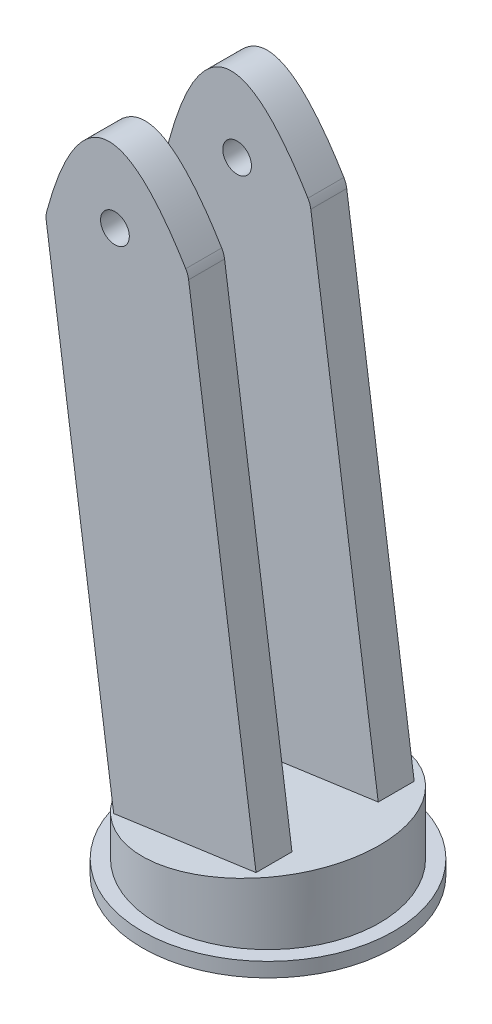
ISO-10303-21;
HEADER;
FILE_DESCRIPTION(('STEP AP214'),'2;1');
FILE_NAME('part.step','',(''),(''),'','','');
FILE_SCHEMA(('AUTOMOTIVE_DESIGN { 1 0 10303 214 1 1 1 1 }'));
ENDSEC;
DATA;
#1=APPLICATION_CONTEXT('core data for automotive mechanical design processes');
#2=APPLICATION_PROTOCOL_DEFINITION('international standard','automotive_design',2000,#1);
#3=PRODUCT_CONTEXT('',#1,'mechanical');
#4=PRODUCT('Part','Part','',(#3));
#5=PRODUCT_RELATED_PRODUCT_CATEGORY('part','',(#4));
#6=PRODUCT_DEFINITION_FORMATION('','',#4);
#7=PRODUCT_DEFINITION_CONTEXT('part definition',#1,'design');
#8=PRODUCT_DEFINITION('design','',#6,#7);
#9=PRODUCT_DEFINITION_SHAPE('','',#8);
#10=(LENGTH_UNIT() NAMED_UNIT(*) SI_UNIT(.MILLI.,.METRE.));
#11=(NAMED_UNIT(*) PLANE_ANGLE_UNIT() SI_UNIT($,.RADIAN.));
#12=(NAMED_UNIT(*) SI_UNIT($,.STERADIAN.) SOLID_ANGLE_UNIT());
#13=UNCERTAINTY_MEASURE_WITH_UNIT(LENGTH_MEASURE(1.E-05),#10,'distance_accuracy_value','');
#14=(GEOMETRIC_REPRESENTATION_CONTEXT(3) GLOBAL_UNCERTAINTY_ASSIGNED_CONTEXT((#13)) GLOBAL_UNIT_ASSIGNED_CONTEXT((#10,
#11,#12)) REPRESENTATION_CONTEXT('',''));
#15=CARTESIAN_POINT('',(0.,0.,0.));
#16=DIRECTION('',(0.,0.,1.));
#17=DIRECTION('',(1.,0.,0.));
#18=AXIS2_PLACEMENT_3D('',#15,#16,#17);
#19=CARTESIAN_POINT('',(-21.6082937179394,86.9277411037629,-6.));
#20=DIRECTION('',(0.,0.,1.));
#21=DIRECTION('',(1.,0.,0.));
#22=AXIS2_PLACEMENT_3D('',#19,#20,#21);
#23=PLANE('',#22);
#24=DIRECTION('',(0.139173100960066,-0.99026806874157,0.));
#25=VECTOR('',#24,1.);
#26=CARTESIAN_POINT('',(-1.80293234310799,89.7112031229642,-6.));
#27=LINE('',#26,#25);
#28=CARTESIAN_POINT('',(-0.0484230605807445,77.2272208964279,-6.));
#29=VERTEX_POINT('',#28);
#30=CARTESIAN_POINT('',(9.33091573369727,10.4897576236386,-6.));
#31=VERTEX_POINT('',#30);
#32=EDGE_CURVE('E280',#29,#31,#27,.T.);
#33=ORIENTED_EDGE('',*,*,#32,.F.);
#34=CARTESIAN_POINT('',(-3.01922726680545,76.8097015935476,-6.));
#35=DIRECTION('',(0.,0.,1.));
#36=DIRECTION('',(1.,0.,0.));
#37=AXIS2_PLACEMENT_3D('',#34,#35,#36);
#38=CIRCLE('',#37,3.);
#39=CARTESIAN_POINT('',(-0.45097420467747,78.3602099646538,-6.));
#40=VERTEX_POINT('',#39);
#41=EDGE_CURVE('E377',#29,#40,#38,.T.);
#42=ORIENTED_EDGE('',*,*,#41,.T.);
#43=CARTESIAN_POINT('',(-19.9382165064186,75.044524278864,-6.));
#44=CARTESIAN_POINT('',(-13.3756902420445,100.202688938262,-6.));
#45=CARTESIAN_POINT('',(-0.132855131587199,77.8279862980654,-6.));
#46=B_SPLINE_CURVE_WITH_KNOTS('',2,(#43,#44,#45),.UNSPECIFIED.,.F.,.F.,(3,3),(0.,1.),.UNSPECIFIED.);
#47=CARTESIAN_POINT('',(-19.7791215508712,75.6438160033689,-6.));
#48=VERTEX_POINT('',#47);
#49=EDGE_CURVE('E269',#40,#48,#46,.F.);
#50=ORIENTED_EDGE('',*,*,#49,.T.);
#51=CARTESIAN_POINT('',(-16.8829802291874,74.8612781801067,-6.));
#52=DIRECTION('',(0.,0.,1.));
#53=DIRECTION('',(1.,0.,0.));
#54=AXIS2_PLACEMENT_3D('',#51,#52,#53);
#55=CIRCLE('',#54,3.);
#56=CARTESIAN_POINT('',(-19.8537844354122,74.4437588772265,-6.));
#57=VERTEX_POINT('',#56);
#58=EDGE_CURVE('E378',#48,#57,#55,.T.);
#59=ORIENTED_EDGE('',*,*,#58,.T.);
#60=DIRECTION('',(0.139173100960066,-0.99026806874157,0.));
#61=VECTOR('',#60,1.);
#62=CARTESIAN_POINT('',(-21.6082937179394,86.9277411037629,-6.));
#63=LINE('',#62,#61);
#64=CARTESIAN_POINT('',(-10.4744456411341,7.70629560443725,-6.));
#65=VERTEX_POINT('',#64);
#66=EDGE_CURVE('E282',#57,#65,#63,.T.);
#67=ORIENTED_EDGE('',*,*,#66,.T.);
#68=DIRECTION('',(-0.99026806874157,-0.139173100960066,0.));
#69=VECTOR('',#68,1.);
#70=CARTESIAN_POINT('',(-10.4744456411341,7.70629560443725,-6.));
#71=LINE('',#70,#69);
#72=EDGE_CURVE('E268',#31,#65,#71,.T.);
#73=ORIENTED_EDGE('',*,*,#72,.F.);
#74=EDGE_LOOP('',(#33,#42,#50,#59,#67,#73));
#75=FACE_BOUND('',#74,.T.);
#76=CARTESIAN_POINT('',(-10.3002046834998,78.3194721133635,-6.));
#77=DIRECTION('',(0.,0.,1.));
#78=DIRECTION('',(1.,0.,0.));
#79=AXIS2_PLACEMENT_3D('',#76,#77,#78);
#80=CIRCLE('',#79,2.);
#81=CARTESIAN_POINT('',(-8.30020468349977,78.3194721133635,-6.));
#82=VERTEX_POINT('',#81);
#83=EDGE_CURVE('E459',#82,#82,#80,.F.);
#84=ORIENTED_EDGE('',*,*,#83,.T.);
#85=EDGE_LOOP('',(#84));
#86=FACE_BOUND('',#85,.T.);
#87=ADVANCED_FACE('F159',(#75,#86),#23,.T.);
#88=CARTESIAN_POINT('',(-21.6082937179394,86.9277411037629,-11.));
#89=DIRECTION('',(0.,0.,-1.));
#90=DIRECTION('',(-1.,0.,0.));
#91=AXIS2_PLACEMENT_3D('',#88,#89,#90);
#92=PLANE('',#91);
#93=CARTESIAN_POINT('',(-19.9382165064186,75.044524278864,-11.));
#94=CARTESIAN_POINT('',(-13.3756902420445,100.202688938262,-11.));
#95=CARTESIAN_POINT('',(-0.132855131587199,77.8279862980654,-11.));
#96=B_SPLINE_CURVE_WITH_KNOTS('',2,(#93,#94,#95),.UNSPECIFIED.,.F.,.F.,(3,3),(0.,1.),.UNSPECIFIED.);
#97=CARTESIAN_POINT('',(-19.7791215508712,75.6438160033689,-11.));
#98=VERTEX_POINT('',#97);
#99=CARTESIAN_POINT('',(-0.45097420467747,78.3602099646538,-11.));
#100=VERTEX_POINT('',#99);
#101=EDGE_CURVE('E388',#98,#100,#96,.T.);
#102=ORIENTED_EDGE('',*,*,#101,.T.);
#103=CARTESIAN_POINT('',(-3.01922726680545,76.8097015935476,-11.));
#104=DIRECTION('',(0.,0.,-1.));
#105=DIRECTION('',(-1.,0.,0.));
#106=AXIS2_PLACEMENT_3D('',#103,#104,#105);
#107=CIRCLE('',#106,3.);
#108=CARTESIAN_POINT('',(-0.0484230605807445,77.2272208964279,-11.));
#109=VERTEX_POINT('',#108);
#110=EDGE_CURVE('E167',#100,#109,#107,.T.);
#111=ORIENTED_EDGE('',*,*,#110,.T.);
#112=DIRECTION('',(0.139173100960066,-0.99026806874157,0.));
#113=VECTOR('',#112,1.);
#114=CARTESIAN_POINT('',(-1.80293234310799,89.7112031229642,-11.));
#115=LINE('',#114,#113);
#116=CARTESIAN_POINT('',(9.33091573369727,10.4897576236386,-11.));
#117=VERTEX_POINT('',#116);
#118=EDGE_CURVE('E257',#109,#117,#115,.T.);
#119=ORIENTED_EDGE('',*,*,#118,.T.);
#120=DIRECTION('',(0.99026806874157,0.139173100960066,0.));
#121=VECTOR('',#120,1.);
#122=CARTESIAN_POINT('',(-10.4744456411341,7.70629560443725,-11.));
#123=LINE('',#122,#121);
#124=CARTESIAN_POINT('',(-10.4744456411341,7.70629560443725,-11.));
#125=VERTEX_POINT('',#124);
#126=EDGE_CURVE('E258',#125,#117,#123,.T.);
#127=ORIENTED_EDGE('',*,*,#126,.F.);
#128=DIRECTION('',(0.139173100960066,-0.99026806874157,0.));
#129=VECTOR('',#128,1.);
#130=CARTESIAN_POINT('',(-21.6082937179394,86.9277411037629,-11.));
#131=LINE('',#130,#129);
#132=CARTESIAN_POINT('',(-19.8537844354122,74.4437588772265,-11.));
#133=VERTEX_POINT('',#132);
#134=EDGE_CURVE('E250',#133,#125,#131,.T.);
#135=ORIENTED_EDGE('',*,*,#134,.F.);
#136=CARTESIAN_POINT('',(-16.8829802291874,74.8612781801067,-11.));
#137=DIRECTION('',(0.,0.,-1.));
#138=DIRECTION('',(-1.,0.,0.));
#139=AXIS2_PLACEMENT_3D('',#136,#137,#138);
#140=CIRCLE('',#139,3.);
#141=EDGE_CURVE('E174',#133,#98,#140,.T.);
#142=ORIENTED_EDGE('',*,*,#141,.T.);
#143=EDGE_LOOP('',(#102,#111,#119,#127,#135,#142));
#144=FACE_BOUND('',#143,.T.);
#145=CARTESIAN_POINT('',(-10.3002046834998,78.3194721133635,-11.));
#146=DIRECTION('',(0.,0.,1.));
#147=DIRECTION('',(1.,0.,0.));
#148=AXIS2_PLACEMENT_3D('',#145,#146,#147);
#149=CIRCLE('',#148,2.);
#150=CARTESIAN_POINT('',(-8.30020468349977,78.3194721133635,-11.));
#151=VERTEX_POINT('',#150);
#152=EDGE_CURVE('E470',#151,#151,#149,.T.);
#153=ORIENTED_EDGE('',*,*,#152,.T.);
#154=EDGE_LOOP('',(#153));
#155=FACE_BOUND('',#154,.T.);
#156=ADVANCED_FACE('F271',(#144,#155),#92,.T.);
#157=CARTESIAN_POINT('',(-1.80293234310799,89.7112031229642,-11.));
#158=DIRECTION('',(0.99026806874157,0.139173100960066,0.));
#159=DIRECTION('',(-0.139173100960066,0.99026806874157,0.));
#160=AXIS2_PLACEMENT_3D('',#157,#158,#159);
#161=PLANE('',#160);
#162=ORIENTED_EDGE('',*,*,#118,.F.);
#163=DIRECTION('',(0.,0.,-1.));
#164=VECTOR('',#163,1.);
#165=CARTESIAN_POINT('',(-0.0484230605807445,77.2272208964279,-11.));
#166=LINE('',#165,#164);
#167=EDGE_CURVE('E376',#109,#29,#166,.F.);
#168=ORIENTED_EDGE('',*,*,#167,.T.);
#169=ORIENTED_EDGE('',*,*,#32,.T.);
#170=DIRECTION('',(0.,0.,1.));
#171=VECTOR('',#170,1.);
#172=CARTESIAN_POINT('',(9.33091573369727,10.4897576236386,-11.));
#173=LINE('',#172,#171);
#174=EDGE_CURVE('E274',#117,#31,#173,.T.);
#175=ORIENTED_EDGE('',*,*,#174,.F.);
#176=EDGE_LOOP('',(#162,#168,#169,#175));
#177=FACE_BOUND('',#176,.T.);
#178=ADVANCED_FACE('F362',(#177),#161,.T.);
#179=CARTESIAN_POINT('',(-21.6082937179394,86.9277411037629,-11.));
#180=DIRECTION('',(-0.99026806874157,-0.139173100960066,0.));
#181=DIRECTION('',(0.139173100960066,-0.99026806874157,0.));
#182=AXIS2_PLACEMENT_3D('',#179,#180,#181);
#183=PLANE('',#182);
#184=ORIENTED_EDGE('',*,*,#66,.F.);
#185=DIRECTION('',(0.,0.,-1.));
#186=VECTOR('',#185,1.);
#187=CARTESIAN_POINT('',(-19.8537844354122,74.4437588772265,-11.));
#188=LINE('',#187,#186);
#189=EDGE_CURVE('E13',#57,#133,#188,.T.);
#190=ORIENTED_EDGE('',*,*,#189,.T.);
#191=ORIENTED_EDGE('',*,*,#134,.T.);
#192=DIRECTION('',(0.,0.,-1.));
#193=VECTOR('',#192,1.);
#194=CARTESIAN_POINT('',(-10.4744456411341,7.70629560443725,-11.));
#195=LINE('',#194,#193);
#196=EDGE_CURVE('E254',#65,#125,#195,.T.);
#197=ORIENTED_EDGE('',*,*,#196,.F.);
#198=EDGE_LOOP('',(#184,#190,#191,#197));
#199=FACE_BOUND('',#198,.T.);
#200=ADVANCED_FACE('F253',(#199),#183,.T.);
#201=CARTESIAN_POINT('',(-1.26495260183753,9.00060544336586,0.));
#202=DIRECTION('',(-0.139173100960066,0.99026806874157,0.));
#203=DIRECTION('',(-0.99026806874157,-0.139173100960066,0.));
#204=AXIS2_PLACEMENT_3D('',#201,#202,#203);
#205=PLANE('',#204);
#206=ORIENTED_EDGE('',*,*,#196,.T.);
#207=ORIENTED_EDGE('',*,*,#126,.T.);
#208=ORIENTED_EDGE('',*,*,#174,.T.);
#209=ORIENTED_EDGE('',*,*,#72,.T.);
#210=EDGE_LOOP('',(#206,#207,#208,#209));
#211=FACE_BOUND('',#210,.T.);
#212=CARTESIAN_POINT('',(0.,9.17838293788707,0.));
#213=DIRECTION('',(-0.139173100960066,0.99026806874157,0.));
#214=DIRECTION('',(-0.99026806874157,-0.139173100960066,0.));
#215=AXIS2_PLACEMENT_3D('',#212,#213,#214);
#216=ELLIPSE('',#215,15.6523273740386,15.5);
#217=CARTESIAN_POINT('',(-15.5,7.,0.));
#218=VERTEX_POINT('',#217);
#219=EDGE_CURVE('E403',#218,#218,#216,.T.);
#220=ORIENTED_EDGE('',*,*,#219,.T.);
#221=EDGE_LOOP('',(#220));
#222=FACE_BOUND('',#221,.T.);
#223=DIRECTION('',(0.99026806874157,0.139173100960066,0.));
#224=VECTOR('',#223,1.);
#225=CARTESIAN_POINT('',(-10.4744456411341,7.70629560443725,11.));
#226=LINE('',#225,#224);
#227=CARTESIAN_POINT('',(-10.4744456411341,7.70629560443725,11.));
#228=VERTEX_POINT('',#227);
#229=CARTESIAN_POINT('',(9.33091573369727,10.4897576236386,11.));
#230=VERTEX_POINT('',#229);
#231=EDGE_CURVE('E598',#228,#230,#226,.T.);
#232=ORIENTED_EDGE('',*,*,#231,.F.);
#233=DIRECTION('',(0.,0.,1.));
#234=VECTOR('',#233,1.);
#235=CARTESIAN_POINT('',(-10.4744456411341,7.70629560443725,11.));
#236=LINE('',#235,#234);
#237=CARTESIAN_POINT('',(-10.4744456411341,7.70629560443725,6.));
#238=VERTEX_POINT('',#237);
#239=EDGE_CURVE('E436',#238,#228,#236,.T.);
#240=ORIENTED_EDGE('',*,*,#239,.F.);
#241=DIRECTION('',(-0.99026806874157,-0.139173100960066,0.));
#242=VECTOR('',#241,1.);
#243=CARTESIAN_POINT('',(-10.4744456411341,7.70629560443725,6.));
#244=LINE('',#243,#242);
#245=CARTESIAN_POINT('',(9.33091573369727,10.4897576236386,6.));
#246=VERTEX_POINT('',#245);
#247=EDGE_CURVE('E608',#246,#238,#244,.T.);
#248=ORIENTED_EDGE('',*,*,#247,.F.);
#249=DIRECTION('',(0.,0.,-1.));
#250=VECTOR('',#249,1.);
#251=CARTESIAN_POINT('',(9.33091573369727,10.4897576236386,11.));
#252=LINE('',#251,#250);
#253=EDGE_CURVE('E426',#230,#246,#252,.T.);
#254=ORIENTED_EDGE('',*,*,#253,.F.);
#255=EDGE_LOOP('',(#232,#240,#248,#254));
#256=FACE_BOUND('',#255,.T.);
#257=ADVANCED_FACE('F263',(#211,#222,#256),#205,.T.);
#258=CARTESIAN_POINT('',(0.,12.,0.));
#259=DIRECTION('',(0.,-1.,0.));
#260=DIRECTION('',(0.,0.,-1.));
#261=AXIS2_PLACEMENT_3D('',#258,#259,#260);
#262=CYLINDRICAL_SURFACE('',#261,15.5);
#263=CARTESIAN_POINT('',(0.,2.,0.));
#264=DIRECTION('',(0.,1.,0.));
#265=DIRECTION('',(0.,0.,1.));
#266=AXIS2_PLACEMENT_3D('',#263,#264,#265);
#267=CIRCLE('',#266,15.5);
#268=CARTESIAN_POINT('',(0.,2.,15.5));
#269=VERTEX_POINT('',#268);
#270=EDGE_CURVE('E615',#269,#269,#267,.T.);
#271=ORIENTED_EDGE('',*,*,#270,.T.);
#272=EDGE_LOOP('',(#271));
#273=FACE_BOUND('',#272,.T.);
#274=ORIENTED_EDGE('',*,*,#219,.F.);
#275=EDGE_LOOP('',(#274));
#276=FACE_BOUND('',#275,.T.);
#277=ADVANCED_FACE('F326',(#273,#276),#262,.T.);
#278=CARTESIAN_POINT('',(0.,2.,0.));
#279=DIRECTION('',(0.,-1.,0.));
#280=DIRECTION('',(0.,0.,-1.));
#281=AXIS2_PLACEMENT_3D('',#278,#279,#280);
#282=CYLINDRICAL_SURFACE('',#281,17.5);
#283=CARTESIAN_POINT('',(0.,2.,0.));
#284=DIRECTION('',(0.,1.,0.));
#285=DIRECTION('',(0.,0.,1.));
#286=AXIS2_PLACEMENT_3D('',#283,#284,#285);
#287=CIRCLE('',#286,17.5);
#288=CARTESIAN_POINT('',(0.,2.,17.5));
#289=VERTEX_POINT('',#288);
#290=EDGE_CURVE('E618',#289,#289,#287,.T.);
#291=ORIENTED_EDGE('',*,*,#290,.F.);
#292=EDGE_LOOP('',(#291));
#293=FACE_BOUND('',#292,.T.);
#294=CARTESIAN_POINT('',(0.,0.,0.));
#295=DIRECTION('',(0.,1.,0.));
#296=DIRECTION('',(0.,0.,1.));
#297=AXIS2_PLACEMENT_3D('',#294,#295,#296);
#298=CIRCLE('',#297,17.5);
#299=CARTESIAN_POINT('',(0.,0.,17.5));
#300=VERTEX_POINT('',#299);
#301=EDGE_CURVE('E614',#300,#300,#298,.T.);
#302=ORIENTED_EDGE('',*,*,#301,.T.);
#303=EDGE_LOOP('',(#302));
#304=FACE_BOUND('',#303,.T.);
#305=ADVANCED_FACE('F329',(#293,#304),#282,.T.);
#306=CARTESIAN_POINT('',(0.,2.,0.));
#307=DIRECTION('',(0.,1.,0.));
#308=DIRECTION('',(0.,0.,1.));
#309=AXIS2_PLACEMENT_3D('',#306,#307,#308);
#310=PLANE('',#309);
#311=ORIENTED_EDGE('',*,*,#270,.F.);
#312=EDGE_LOOP('',(#311));
#313=FACE_BOUND('',#312,.T.);
#314=ORIENTED_EDGE('',*,*,#290,.T.);
#315=EDGE_LOOP('',(#314));
#316=FACE_BOUND('',#315,.T.);
#317=ADVANCED_FACE('F331',(#313,#316),#310,.T.);
#318=CARTESIAN_POINT('',(0.,0.,0.));
#319=DIRECTION('',(0.,1.,0.));
#320=DIRECTION('',(0.,0.,1.));
#321=AXIS2_PLACEMENT_3D('',#318,#319,#320);
#322=PLANE('',#321);
#323=ORIENTED_EDGE('',*,*,#301,.F.);
#324=EDGE_LOOP('',(#323));
#325=FACE_BOUND('',#324,.T.);
#326=ADVANCED_FACE('F322',(#325),#322,.F.);
#327=CARTESIAN_POINT('',(-21.6082937179394,86.9277411037629,11.));
#328=DIRECTION('',(0.99026806874157,0.139173100960066,0.));
#329=DIRECTION('',(-0.139173100960066,0.99026806874157,0.));
#330=AXIS2_PLACEMENT_3D('',#327,#328,#329);
#331=PLANE('',#330);
#332=DIRECTION('',(0.139173100960066,-0.99026806874157,0.));
#333=VECTOR('',#332,1.);
#334=CARTESIAN_POINT('',(-21.6082937179394,86.9277411037629,11.));
#335=LINE('',#334,#333);
#336=CARTESIAN_POINT('',(-19.8537844354122,74.4437588772265,11.));
#337=VERTEX_POINT('',#336);
#338=EDGE_CURVE('E612',#337,#228,#335,.T.);
#339=ORIENTED_EDGE('',*,*,#338,.F.);
#340=DIRECTION('',(0.,0.,1.));
#341=VECTOR('',#340,1.);
#342=CARTESIAN_POINT('',(-19.8537844354122,74.4437588772265,11.));
#343=LINE('',#342,#341);
#344=CARTESIAN_POINT('',(-19.8537844354122,74.4437588772265,6.));
#345=VERTEX_POINT('',#344);
#346=EDGE_CURVE('E379',#337,#345,#343,.F.);
#347=ORIENTED_EDGE('',*,*,#346,.T.);
#348=DIRECTION('',(0.139173100960066,-0.99026806874157,0.));
#349=VECTOR('',#348,1.);
#350=CARTESIAN_POINT('',(-21.6082937179394,86.9277411037629,6.));
#351=LINE('',#350,#349);
#352=EDGE_CURVE('E429',#345,#238,#351,.T.);
#353=ORIENTED_EDGE('',*,*,#352,.T.);
#354=ORIENTED_EDGE('',*,*,#239,.T.);
#355=EDGE_LOOP('',(#339,#347,#353,#354));
#356=FACE_BOUND('',#355,.T.);
#357=ADVANCED_FACE('F318',(#356),#331,.F.);
#358=CARTESIAN_POINT('',(-21.6082937179394,86.9277411037629,11.));
#359=DIRECTION('',(0.,0.,-1.));
#360=DIRECTION('',(-1.,0.,0.));
#361=AXIS2_PLACEMENT_3D('',#358,#359,#360);
#362=PLANE('',#361);
#363=CARTESIAN_POINT('',(-10.3002046834998,78.3194721133635,11.));
#364=DIRECTION('',(0.,0.,1.));
#365=DIRECTION('',(1.,0.,0.));
#366=AXIS2_PLACEMENT_3D('',#363,#364,#365);
#367=CIRCLE('',#366,2.);
#368=CARTESIAN_POINT('',(-8.30020468349977,78.3194721133635,11.));
#369=VERTEX_POINT('',#368);
#370=EDGE_CURVE('E284',#369,#369,#367,.T.);
#371=ORIENTED_EDGE('',*,*,#370,.F.);
#372=EDGE_LOOP('',(#371));
#373=FACE_BOUND('',#372,.T.);
#374=DIRECTION('',(0.139173100960066,-0.99026806874157,0.));
#375=VECTOR('',#374,1.);
#376=CARTESIAN_POINT('',(-1.80293234310799,89.7112031229642,11.));
#377=LINE('',#376,#375);
#378=CARTESIAN_POINT('',(-0.0484230605807445,77.2272208964279,11.));
#379=VERTEX_POINT('',#378);
#380=EDGE_CURVE('E428',#379,#230,#377,.T.);
#381=ORIENTED_EDGE('',*,*,#380,.F.);
#382=CARTESIAN_POINT('',(-3.01922726680545,76.8097015935476,11.));
#383=DIRECTION('',(0.,0.,-1.));
#384=DIRECTION('',(-1.,0.,0.));
#385=AXIS2_PLACEMENT_3D('',#382,#383,#384);
#386=CIRCLE('',#385,3.);
#387=CARTESIAN_POINT('',(-0.45097420467747,78.3602099646538,11.));
#388=VERTEX_POINT('',#387);
#389=EDGE_CURVE('E405',#379,#388,#386,.F.);
#390=ORIENTED_EDGE('',*,*,#389,.T.);
#391=CARTESIAN_POINT('',(-19.9382165064186,75.044524278864,11.));
#392=CARTESIAN_POINT('',(-13.3756902420445,100.202688938262,11.));
#393=CARTESIAN_POINT('',(-0.132855131587199,77.8279862980654,11.));
#394=B_SPLINE_CURVE_WITH_KNOTS('',2,(#391,#392,#393),.UNSPECIFIED.,.F.,.F.,(3,3),(0.,1.),.UNSPECIFIED.);
#395=CARTESIAN_POINT('',(-19.7791215508712,75.6438160033689,11.));
#396=VERTEX_POINT('',#395);
#397=EDGE_CURVE('E292',#396,#388,#394,.T.);
#398=ORIENTED_EDGE('',*,*,#397,.F.);
#399=CARTESIAN_POINT('',(-16.8829802291874,74.8612781801067,11.));
#400=DIRECTION('',(0.,0.,-1.));
#401=DIRECTION('',(-1.,0.,0.));
#402=AXIS2_PLACEMENT_3D('',#399,#400,#401);
#403=CIRCLE('',#402,3.);
#404=EDGE_CURVE('E402',#396,#337,#403,.F.);
#405=ORIENTED_EDGE('',*,*,#404,.T.);
#406=ORIENTED_EDGE('',*,*,#338,.T.);
#407=ORIENTED_EDGE('',*,*,#231,.T.);
#408=EDGE_LOOP('',(#381,#390,#398,#405,#406,#407));
#409=FACE_BOUND('',#408,.T.);
#410=ADVANCED_FACE('F314',(#373,#409),#362,.F.);
#411=CARTESIAN_POINT('',(-1.80293234310799,89.7112031229642,11.));
#412=DIRECTION('',(-0.99026806874157,-0.139173100960066,0.));
#413=DIRECTION('',(0.139173100960066,-0.99026806874157,0.));
#414=AXIS2_PLACEMENT_3D('',#411,#412,#413);
#415=PLANE('',#414);
#416=DIRECTION('',(0.139173100960066,-0.99026806874157,0.));
#417=VECTOR('',#416,1.);
#418=CARTESIAN_POINT('',(-1.80293234310799,89.7112031229642,6.));
#419=LINE('',#418,#417);
#420=CARTESIAN_POINT('',(-0.0484230605807445,77.2272208964279,6.));
#421=VERTEX_POINT('',#420);
#422=EDGE_CURVE('E418',#421,#246,#419,.T.);
#423=ORIENTED_EDGE('',*,*,#422,.F.);
#424=DIRECTION('',(0.,0.,1.));
#425=VECTOR('',#424,1.);
#426=CARTESIAN_POINT('',(-0.0484230605807445,77.2272208964279,11.));
#427=LINE('',#426,#425);
#428=EDGE_CURVE('E396',#421,#379,#427,.T.);
#429=ORIENTED_EDGE('',*,*,#428,.T.);
#430=ORIENTED_EDGE('',*,*,#380,.T.);
#431=ORIENTED_EDGE('',*,*,#253,.T.);
#432=EDGE_LOOP('',(#423,#429,#430,#431));
#433=FACE_BOUND('',#432,.T.);
#434=ADVANCED_FACE('F310',(#433),#415,.F.);
#435=CARTESIAN_POINT('',(-21.6082937179394,86.9277411037629,6.));
#436=DIRECTION('',(0.,0.,1.));
#437=DIRECTION('',(1.,0.,0.));
#438=AXIS2_PLACEMENT_3D('',#435,#436,#437);
#439=PLANE('',#438);
#440=CARTESIAN_POINT('',(-10.3002046834998,78.3194721133635,6.));
#441=DIRECTION('',(0.,0.,1.));
#442=DIRECTION('',(1.,0.,0.));
#443=AXIS2_PLACEMENT_3D('',#440,#441,#442);
#444=CIRCLE('',#443,2.);
#445=CARTESIAN_POINT('',(-8.30020468349977,78.3194721133635,6.));
#446=VERTEX_POINT('',#445);
#447=EDGE_CURVE('E287',#446,#446,#444,.T.);
#448=ORIENTED_EDGE('',*,*,#447,.T.);
#449=EDGE_LOOP('',(#448));
#450=FACE_BOUND('',#449,.T.);
#451=CARTESIAN_POINT('',(-19.9382165064186,75.044524278864,6.));
#452=CARTESIAN_POINT('',(-13.3756902420445,100.202688938262,6.));
#453=CARTESIAN_POINT('',(-0.132855131587199,77.8279862980654,6.));
#454=B_SPLINE_CURVE_WITH_KNOTS('',2,(#451,#452,#453),.UNSPECIFIED.,.F.,.F.,(3,3),(0.,1.),.UNSPECIFIED.);
#455=CARTESIAN_POINT('',(-19.7791215508712,75.6438160033689,6.));
#456=VERTEX_POINT('',#455);
#457=CARTESIAN_POINT('',(-0.45097420467747,78.3602099646538,6.));
#458=VERTEX_POINT('',#457);
#459=EDGE_CURVE('E421',#456,#458,#454,.T.);
#460=ORIENTED_EDGE('',*,*,#459,.T.);
#461=CARTESIAN_POINT('',(-3.01922726680545,76.8097015935476,6.));
#462=DIRECTION('',(0.,0.,1.));
#463=DIRECTION('',(1.,0.,0.));
#464=AXIS2_PLACEMENT_3D('',#461,#462,#463);
#465=CIRCLE('',#464,3.);
#466=EDGE_CURVE('E382',#458,#421,#465,.F.);
#467=ORIENTED_EDGE('',*,*,#466,.T.);
#468=ORIENTED_EDGE('',*,*,#422,.T.);
#469=ORIENTED_EDGE('',*,*,#247,.T.);
#470=ORIENTED_EDGE('',*,*,#352,.F.);
#471=CARTESIAN_POINT('',(-16.8829802291874,74.8612781801067,6.));
#472=DIRECTION('',(0.,0.,1.));
#473=DIRECTION('',(1.,0.,0.));
#474=AXIS2_PLACEMENT_3D('',#471,#472,#473);
#475=CIRCLE('',#474,3.);
#476=EDGE_CURVE('E412',#345,#456,#475,.F.);
#477=ORIENTED_EDGE('',*,*,#476,.T.);
#478=EDGE_LOOP('',(#460,#467,#468,#469,#470,#477));
#479=FACE_BOUND('',#478,.T.);
#480=ADVANCED_FACE('F305',(#450,#479),#439,.F.);
#481=CARTESIAN_POINT('',(-19.9382165064186,75.044524278864,-17.5));
#482=CARTESIAN_POINT('',(-13.3756902420445,100.202688938262,-17.5));
#483=CARTESIAN_POINT('',(-0.132855131587199,77.8279862980654,-17.5));
#484=B_SPLINE_CURVE_WITH_KNOTS('',2,(#481,#482,#483),.UNSPECIFIED.,.F.,.F.,(3,3),(0.,1.),.UNSPECIFIED.);
#485=DIRECTION('',(0.,0.,1.));
#486=VECTOR('',#485,1.);
#487=SURFACE_OF_LINEAR_EXTRUSION('',#484,#486);
#488=ORIENTED_EDGE('',*,*,#397,.T.);
#489=DIRECTION('',(0.,0.,1.));
#490=VECTOR('',#489,1.);
#491=CARTESIAN_POINT('',(-0.450974204685286,78.3602099646667,11.));
#492=LINE('',#491,#490);
#493=EDGE_CURVE('E410',#388,#458,#492,.F.);
#494=ORIENTED_EDGE('',*,*,#493,.T.);
#495=ORIENTED_EDGE('',*,*,#459,.F.);
#496=DIRECTION('',(0.,0.,1.));
#497=VECTOR('',#496,1.);
#498=CARTESIAN_POINT('',(-19.7791215508673,75.6438160033835,6.));
#499=LINE('',#498,#497);
#500=EDGE_CURVE('E407',#456,#396,#499,.T.);
#501=ORIENTED_EDGE('',*,*,#500,.T.);
#502=EDGE_LOOP('',(#488,#494,#495,#501));
#503=FACE_BOUND('',#502,.T.);
#504=ADVANCED_FACE('F300',(#503),#487,.F.);
#505=CARTESIAN_POINT('',(-10.3002046834998,78.3194721133635,-17.5));
#506=DIRECTION('',(0.,0.,1.));
#507=DIRECTION('',(1.,0.,0.));
#508=AXIS2_PLACEMENT_3D('',#505,#506,#507);
#509=CYLINDRICAL_SURFACE('',#508,2.);
#510=ORIENTED_EDGE('',*,*,#370,.T.);
#511=EDGE_LOOP('',(#510));
#512=FACE_BOUND('',#511,.T.);
#513=ORIENTED_EDGE('',*,*,#447,.F.);
#514=EDGE_LOOP('',(#513));
#515=FACE_BOUND('',#514,.T.);
#516=ADVANCED_FACE('F304',(#512,#515),#509,.F.);
#517=CARTESIAN_POINT('',(-19.9382165064186,75.044524278864,17.5));
#518=CARTESIAN_POINT('',(-13.3756902420445,100.202688938262,17.5));
#519=CARTESIAN_POINT('',(-0.132855131587199,77.8279862980654,17.5));
#520=B_SPLINE_CURVE_WITH_KNOTS('',2,(#517,#518,#519),.UNSPECIFIED.,.F.,.F.,(3,3),(0.,1.),.UNSPECIFIED.);
#521=DIRECTION('',(0.,0.,-1.));
#522=VECTOR('',#521,1.);
#523=SURFACE_OF_LINEAR_EXTRUSION('',#520,#522);
#524=ORIENTED_EDGE('',*,*,#49,.F.);
#525=DIRECTION('',(0.,0.,-1.));
#526=VECTOR('',#525,1.);
#527=CARTESIAN_POINT('',(-0.450974204685286,78.3602099646667,-6.));
#528=LINE('',#527,#526);
#529=EDGE_CURVE('E181',#40,#100,#528,.T.);
#530=ORIENTED_EDGE('',*,*,#529,.T.);
#531=ORIENTED_EDGE('',*,*,#101,.F.);
#532=DIRECTION('',(0.,0.,-1.));
#533=VECTOR('',#532,1.);
#534=CARTESIAN_POINT('',(-19.7791215508673,75.6438160033835,-11.));
#535=LINE('',#534,#533);
#536=EDGE_CURVE('E475',#98,#48,#535,.F.);
#537=ORIENTED_EDGE('',*,*,#536,.T.);
#538=EDGE_LOOP('',(#524,#530,#531,#537));
#539=FACE_BOUND('',#538,.T.);
#540=ADVANCED_FACE('F441',(#539),#523,.T.);
#541=CARTESIAN_POINT('',(-10.3002046834998,78.3194721133635,17.5));
#542=DIRECTION('',(0.,0.,-1.));
#543=DIRECTION('',(-1.,0.,0.));
#544=AXIS2_PLACEMENT_3D('',#541,#542,#543);
#545=CYLINDRICAL_SURFACE('',#544,2.);
#546=ORIENTED_EDGE('',*,*,#83,.F.);
#547=EDGE_LOOP('',(#546));
#548=FACE_BOUND('',#547,.T.);
#549=ORIENTED_EDGE('',*,*,#152,.F.);
#550=EDGE_LOOP('',(#549));
#551=FACE_BOUND('',#550,.T.);
#552=ADVANCED_FACE('F345',(#548,#551),#545,.F.);
#553=CARTESIAN_POINT('',(-3.01922726680545,76.8097015935476,8.5));
#554=DIRECTION('',(0.,0.,1.));
#555=DIRECTION('',(1.,0.,0.));
#556=AXIS2_PLACEMENT_3D('',#553,#554,#555);
#557=CYLINDRICAL_SURFACE('',#556,3.);
#558=ORIENTED_EDGE('',*,*,#466,.F.);
#559=ORIENTED_EDGE('',*,*,#493,.F.);
#560=ORIENTED_EDGE('',*,*,#389,.F.);
#561=ORIENTED_EDGE('',*,*,#428,.F.);
#562=EDGE_LOOP('',(#558,#559,#560,#561));
#563=FACE_BOUND('',#562,.T.);
#564=ADVANCED_FACE('F341',(#563),#557,.T.);
#565=CARTESIAN_POINT('',(-16.8829802291874,74.8612781801067,8.5));
#566=DIRECTION('',(0.,0.,1.));
#567=DIRECTION('',(1.,0.,0.));
#568=AXIS2_PLACEMENT_3D('',#565,#566,#567);
#569=CYLINDRICAL_SURFACE('',#568,3.);
#570=ORIENTED_EDGE('',*,*,#476,.F.);
#571=ORIENTED_EDGE('',*,*,#346,.F.);
#572=ORIENTED_EDGE('',*,*,#404,.F.);
#573=ORIENTED_EDGE('',*,*,#500,.F.);
#574=EDGE_LOOP('',(#570,#571,#572,#573));
#575=FACE_BOUND('',#574,.T.);
#576=ADVANCED_FACE('F344',(#575),#569,.T.);
#577=CARTESIAN_POINT('',(-3.01922726680545,76.8097015935476,-8.5));
#578=DIRECTION('',(0.,0.,-1.));
#579=DIRECTION('',(-1.,0.,0.));
#580=AXIS2_PLACEMENT_3D('',#577,#578,#579);
#581=CYLINDRICAL_SURFACE('',#580,3.);
#582=ORIENTED_EDGE('',*,*,#110,.F.);
#583=ORIENTED_EDGE('',*,*,#529,.F.);
#584=ORIENTED_EDGE('',*,*,#41,.F.);
#585=ORIENTED_EDGE('',*,*,#167,.F.);
#586=EDGE_LOOP('',(#582,#583,#584,#585));
#587=FACE_BOUND('',#586,.T.);
#588=ADVANCED_FACE('F348',(#587),#581,.T.);
#589=CARTESIAN_POINT('',(-16.8829802291874,74.8612781801067,-8.5));
#590=DIRECTION('',(0.,0.,-1.));
#591=DIRECTION('',(-1.,0.,0.));
#592=AXIS2_PLACEMENT_3D('',#589,#590,#591);
#593=CYLINDRICAL_SURFACE('',#592,3.);
#594=ORIENTED_EDGE('',*,*,#58,.F.);
#595=ORIENTED_EDGE('',*,*,#536,.F.);
#596=ORIENTED_EDGE('',*,*,#141,.F.);
#597=ORIENTED_EDGE('',*,*,#189,.F.);
#598=EDGE_LOOP('',(#594,#595,#596,#597));
#599=FACE_BOUND('',#598,.T.);
#600=ADVANCED_FACE('F161',(#599),#593,.T.);
#601=CLOSED_SHELL('',(#87,#156,#178,#200,#257,#277,#305,#317,#326,#357,#410,#434,#480,#504,#516,
#540,#552,#564,#576,#588,#600));
#602=MANIFOLD_SOLID_BREP('B2',#601);
#603=ADVANCED_BREP_SHAPE_REPRESENTATION('',(#18,#602),#14);
#604=SHAPE_DEFINITION_REPRESENTATION(#9,#603);
ENDSEC;
END-ISO-10303-21;
